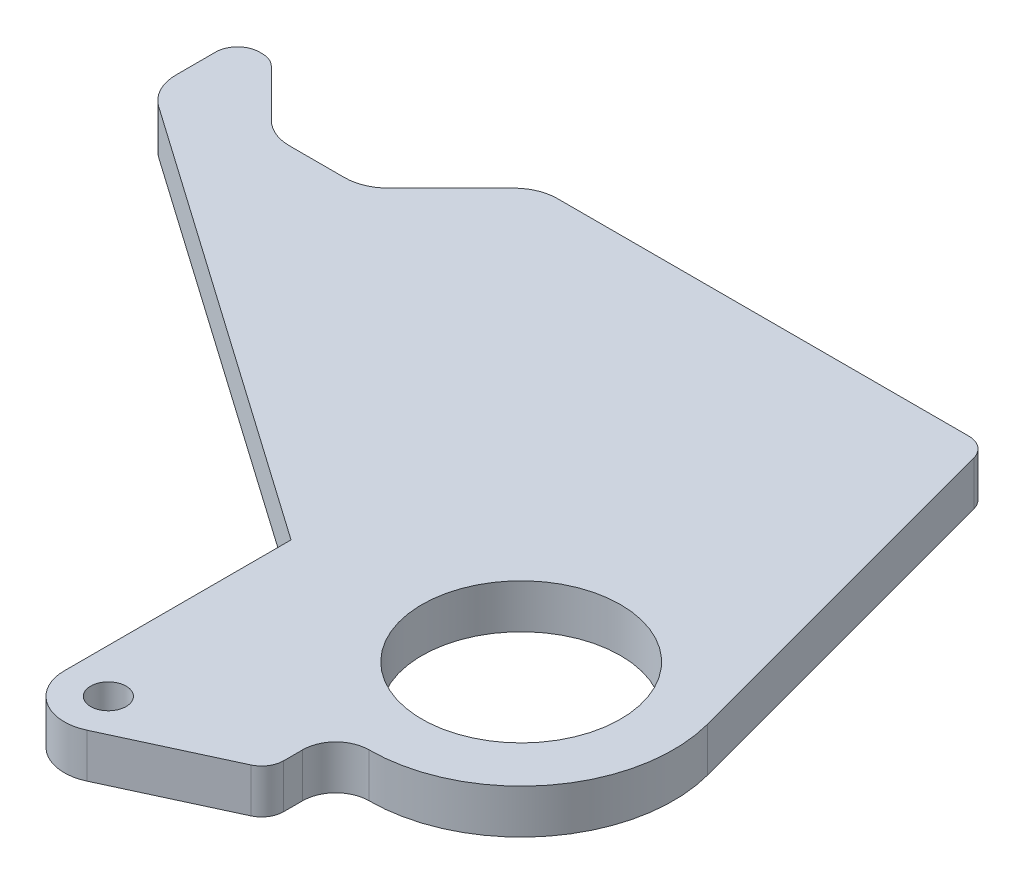
ISO-10303-21;
HEADER;
FILE_DESCRIPTION(('STEP AP214'),'2;1');
FILE_NAME('part.step','',(''),(''),'','','');
FILE_SCHEMA(('AUTOMOTIVE_DESIGN { 1 0 10303 214 1 1 1 1 }'));
ENDSEC;
DATA;
#1=APPLICATION_CONTEXT('core data for automotive mechanical design processes');
#2=APPLICATION_PROTOCOL_DEFINITION('international standard','automotive_design',2000,#1);
#3=PRODUCT_CONTEXT('',#1,'mechanical');
#4=PRODUCT('Part','Part','',(#3));
#5=PRODUCT_RELATED_PRODUCT_CATEGORY('part','',(#4));
#6=PRODUCT_DEFINITION_FORMATION('','',#4);
#7=PRODUCT_DEFINITION_CONTEXT('part definition',#1,'design');
#8=PRODUCT_DEFINITION('design','',#6,#7);
#9=PRODUCT_DEFINITION_SHAPE('','',#8);
#10=(LENGTH_UNIT() NAMED_UNIT(*) SI_UNIT(.MILLI.,.METRE.));
#11=(NAMED_UNIT(*) PLANE_ANGLE_UNIT() SI_UNIT($,.RADIAN.));
#12=(NAMED_UNIT(*) SI_UNIT($,.STERADIAN.) SOLID_ANGLE_UNIT());
#13=UNCERTAINTY_MEASURE_WITH_UNIT(LENGTH_MEASURE(1.E-05),#10,'distance_accuracy_value','');
#14=(GEOMETRIC_REPRESENTATION_CONTEXT(3) GLOBAL_UNCERTAINTY_ASSIGNED_CONTEXT((#13)) GLOBAL_UNIT_ASSIGNED_CONTEXT((#10,
#11,#12)) REPRESENTATION_CONTEXT('',''));
#15=CARTESIAN_POINT('',(0.,0.,0.));
#16=DIRECTION('',(0.,0.,1.));
#17=DIRECTION('',(1.,0.,0.));
#18=AXIS2_PLACEMENT_3D('',#15,#16,#17);
#19=CARTESIAN_POINT('',(4.08001470209326,-6.35,6.35));
#20=DIRECTION('',(0.,1.,0.));
#21=DIRECTION('',(0.,0.,1.));
#22=AXIS2_PLACEMENT_3D('',#19,#20,#21);
#23=CYLINDRICAL_SURFACE('',#22,3.175);
#24=CARTESIAN_POINT('',(4.08001470209326,0.,6.35));
#25=DIRECTION('',(0.,1.,0.));
#26=DIRECTION('',(0.,0.,1.));
#27=AXIS2_PLACEMENT_3D('',#24,#25,#26);
#28=CIRCLE('',#27,3.175);
#29=CARTESIAN_POINT('',(7.14682920056105,0.,5.5282495317995));
#30=VERTEX_POINT('',#29);
#31=CARTESIAN_POINT('',(4.08001470209326,0.,3.175));
#32=VERTEX_POINT('',#31);
#33=EDGE_CURVE('E224',#30,#32,#28,.T.);
#34=ORIENTED_EDGE('',*,*,#33,.F.);
#35=DIRECTION('',(0.,1.,0.));
#36=VECTOR('',#35,1.);
#37=CARTESIAN_POINT('',(7.14682920056105,-6.35,5.5282495317995));
#38=LINE('',#37,#36);
#39=CARTESIAN_POINT('',(7.14682920056105,-6.35,5.5282495317995));
#40=VERTEX_POINT('',#39);
#41=EDGE_CURVE('E11',#40,#30,#38,.T.);
#42=ORIENTED_EDGE('',*,*,#41,.F.);
#43=CARTESIAN_POINT('',(4.08001470209326,-6.35,6.35));
#44=DIRECTION('',(0.,1.,0.));
#45=DIRECTION('',(0.,0.,1.));
#46=AXIS2_PLACEMENT_3D('',#43,#44,#45);
#47=CIRCLE('',#46,3.175);
#48=CARTESIAN_POINT('',(4.08001470209326,-6.35,3.175));
#49=VERTEX_POINT('',#48);
#50=EDGE_CURVE('E287',#40,#49,#47,.T.);
#51=ORIENTED_EDGE('',*,*,#50,.T.);
#52=DIRECTION('',(0.,1.,0.));
#53=VECTOR('',#52,1.);
#54=CARTESIAN_POINT('',(4.08001470209326,-6.35,3.175));
#55=LINE('',#54,#53);
#56=EDGE_CURVE('E46',#49,#32,#55,.T.);
#57=ORIENTED_EDGE('',*,*,#56,.T.);
#58=EDGE_LOOP('',(#34,#42,#51,#57));
#59=FACE_BOUND('',#58,.T.);
#60=ADVANCED_FACE('F43',(#59),#23,.T.);
#61=CARTESIAN_POINT('',(21.1610200394277,-6.35,57.8299217694121));
#62=DIRECTION('',(0.965925826289063,0.,-0.258819045102539));
#63=DIRECTION('',(-0.258819045102539,0.,-0.965925826289064));
#64=AXIS2_PLACEMENT_3D('',#61,#62,#63);
#65=PLANE('',#64);
#66=DIRECTION('',(-0.258819045102539,0.,-0.965925826289063));
#67=VECTOR('',#66,1.);
#68=CARTESIAN_POINT('',(21.1610200394277,0.,57.8299217694121));
#69=LINE('',#68,#67);
#70=CARTESIAN_POINT('',(21.1610200394277,0.,57.8299217694121));
#71=VERTEX_POINT('',#70);
#72=EDGE_CURVE('E285',#71,#30,#69,.T.);
#73=ORIENTED_EDGE('',*,*,#72,.F.);
#74=DIRECTION('',(0.,1.,0.));
#75=VECTOR('',#74,1.);
#76=CARTESIAN_POINT('',(21.1610200394277,-6.35,57.8299217694121));
#77=LINE('',#76,#75);
#78=CARTESIAN_POINT('',(21.1610200394277,-6.35,57.8299217694121));
#79=VERTEX_POINT('',#78);
#80=EDGE_CURVE('E52',#79,#71,#77,.T.);
#81=ORIENTED_EDGE('',*,*,#80,.F.);
#82=DIRECTION('',(-0.258819045102539,0.,-0.965925826289063));
#83=VECTOR('',#82,1.);
#84=CARTESIAN_POINT('',(21.1610200394277,-6.35,57.8299217694121));
#85=LINE('',#84,#83);
#86=EDGE_CURVE('E214',#79,#40,#85,.T.);
#87=ORIENTED_EDGE('',*,*,#86,.T.);
#88=ORIENTED_EDGE('',*,*,#41,.T.);
#89=EDGE_LOOP('',(#73,#81,#87,#88));
#90=FACE_BOUND('',#89,.T.);
#91=ADVANCED_FACE('F327',(#90),#65,.T.);
#92=CARTESIAN_POINT('',(0.,-6.35,63.499999999996));
#93=DIRECTION('',(0.,1.,0.));
#94=DIRECTION('',(0.,0.,1.));
#95=AXIS2_PLACEMENT_3D('',#92,#93,#94);
#96=CYLINDRICAL_SURFACE('',#95,21.9075);
#97=CARTESIAN_POINT('',(0.,0.,63.499999999996));
#98=DIRECTION('',(0.,1.,0.));
#99=DIRECTION('',(0.,0.,1.));
#100=AXIS2_PLACEMENT_3D('',#97,#98,#99);
#101=CIRCLE('',#100,21.9075);
#102=CARTESIAN_POINT('',(0.,0.,85.4074999999961));
#103=VERTEX_POINT('',#102);
#104=EDGE_CURVE('E201',#103,#71,#101,.T.);
#105=ORIENTED_EDGE('',*,*,#104,.F.);
#106=DIRECTION('',(0.,1.,0.));
#107=VECTOR('',#106,1.);
#108=CARTESIAN_POINT('',(0.,-6.35,85.4074999999961));
#109=LINE('',#108,#107);
#110=CARTESIAN_POINT('',(0.,-6.35,85.4074999999961));
#111=VERTEX_POINT('',#110);
#112=EDGE_CURVE('E196',#111,#103,#109,.T.);
#113=ORIENTED_EDGE('',*,*,#112,.F.);
#114=CARTESIAN_POINT('',(0.,-6.35,63.499999999996));
#115=DIRECTION('',(0.,1.,0.));
#116=DIRECTION('',(0.,0.,1.));
#117=AXIS2_PLACEMENT_3D('',#114,#115,#116);
#118=CIRCLE('',#117,21.9075);
#119=EDGE_CURVE('E199',#111,#79,#118,.T.);
#120=ORIENTED_EDGE('',*,*,#119,.T.);
#121=ORIENTED_EDGE('',*,*,#80,.T.);
#122=EDGE_LOOP('',(#105,#113,#120,#121));
#123=FACE_BOUND('',#122,.T.);
#124=ADVANCED_FACE('F198',(#123),#96,.T.);
#125=CARTESIAN_POINT('',(0.,-6.35,90.1699999999961));
#126=DIRECTION('',(0.,1.,0.));
#127=DIRECTION('',(0.,0.,1.));
#128=AXIS2_PLACEMENT_3D('',#125,#126,#127);
#129=CYLINDRICAL_SURFACE('',#128,4.76250000000001);
#130=CARTESIAN_POINT('',(0.,0.,90.1699999999961));
#131=DIRECTION('',(0.,-1.,0.));
#132=DIRECTION('',(0.,0.,-1.));
#133=AXIS2_PLACEMENT_3D('',#130,#131,#132);
#134=CIRCLE('',#133,4.76250000000001);
#135=CARTESIAN_POINT('',(-4.7625,0.,90.1699999999961));
#136=VERTEX_POINT('',#135);
#137=EDGE_CURVE('E282',#136,#103,#134,.T.);
#138=ORIENTED_EDGE('',*,*,#137,.F.);
#139=DIRECTION('',(0.,1.,0.));
#140=VECTOR('',#139,1.);
#141=CARTESIAN_POINT('',(-4.7625,-6.35,90.1699999999961));
#142=LINE('',#141,#140);
#143=CARTESIAN_POINT('',(-4.7625,-6.35,90.1699999999961));
#144=VERTEX_POINT('',#143);
#145=EDGE_CURVE('E206',#144,#136,#142,.T.);
#146=ORIENTED_EDGE('',*,*,#145,.F.);
#147=CARTESIAN_POINT('',(0.,-6.35,90.1699999999961));
#148=DIRECTION('',(0.,-1.,0.));
#149=DIRECTION('',(0.,0.,-1.));
#150=AXIS2_PLACEMENT_3D('',#147,#148,#149);
#151=CIRCLE('',#150,4.76250000000001);
#152=EDGE_CURVE('E212',#144,#111,#151,.T.);
#153=ORIENTED_EDGE('',*,*,#152,.T.);
#154=ORIENTED_EDGE('',*,*,#112,.T.);
#155=EDGE_LOOP('',(#138,#146,#153,#154));
#156=FACE_BOUND('',#155,.T.);
#157=ADVANCED_FACE('F216',(#156),#129,.F.);
#158=CARTESIAN_POINT('',(-4.7625,-6.35,92.9032270908187));
#159=DIRECTION('',(1.,0.,0.));
#160=DIRECTION('',(0.,0.,-1.));
#161=AXIS2_PLACEMENT_3D('',#158,#159,#160);
#162=PLANE('',#161);
#163=DIRECTION('',(0.,0.,-1.));
#164=VECTOR('',#163,1.);
#165=CARTESIAN_POINT('',(-4.7625,0.,92.9032270908187));
#166=LINE('',#165,#164);
#167=CARTESIAN_POINT('',(-4.76249999999999,0.,92.9032270908187));
#168=VERTEX_POINT('',#167);
#169=EDGE_CURVE('E279',#168,#136,#166,.T.);
#170=ORIENTED_EDGE('',*,*,#169,.F.);
#171=DIRECTION('',(0.,1.,0.));
#172=VECTOR('',#171,1.);
#173=CARTESIAN_POINT('',(-4.76249999999999,-6.35,92.9032270908187));
#174=LINE('',#173,#172);
#175=CARTESIAN_POINT('',(-4.76249999999999,-6.35,92.9032270908187));
#176=VERTEX_POINT('',#175);
#177=EDGE_CURVE('E291',#176,#168,#174,.T.);
#178=ORIENTED_EDGE('',*,*,#177,.F.);
#179=DIRECTION('',(0.,0.,-1.));
#180=VECTOR('',#179,1.);
#181=CARTESIAN_POINT('',(-4.7625,-6.35,92.9032270908187));
#182=LINE('',#181,#180);
#183=EDGE_CURVE('E217',#176,#144,#182,.T.);
#184=ORIENTED_EDGE('',*,*,#183,.T.);
#185=ORIENTED_EDGE('',*,*,#145,.T.);
#186=EDGE_LOOP('',(#170,#178,#184,#185));
#187=FACE_BOUND('',#186,.T.);
#188=ADVANCED_FACE('F340',(#187),#162,.T.);
#189=CARTESIAN_POINT('',(-7.9375,-6.35,92.9032270908187));
#190=DIRECTION('',(0.,1.,0.));
#191=DIRECTION('',(0.,0.,1.));
#192=AXIS2_PLACEMENT_3D('',#189,#190,#191);
#193=CYLINDRICAL_SURFACE('',#192,3.17500000000001);
#194=CARTESIAN_POINT('',(-7.9375,0.,92.9032270908187));
#195=DIRECTION('',(0.,1.,0.));
#196=DIRECTION('',(0.,0.,1.));
#197=AXIS2_PLACEMENT_3D('',#194,#195,#196);
#198=CIRCLE('',#197,3.17500000000001);
#199=CARTESIAN_POINT('',(-6.60416199196349,0.,95.7846910861387));
#200=VERTEX_POINT('',#199);
#201=EDGE_CURVE('E276',#200,#168,#198,.T.);
#202=ORIENTED_EDGE('',*,*,#201,.F.);
#203=DIRECTION('',(0.,1.,0.));
#204=VECTOR('',#203,1.);
#205=CARTESIAN_POINT('',(-6.60416199196349,-6.35,95.7846910861387));
#206=LINE('',#205,#204);
#207=CARTESIAN_POINT('',(-6.60416199196349,-6.35,95.7846910861387));
#208=VERTEX_POINT('',#207);
#209=EDGE_CURVE('E293',#208,#200,#206,.T.);
#210=ORIENTED_EDGE('',*,*,#209,.F.);
#211=CARTESIAN_POINT('',(-7.9375,-6.35,92.9032270908187));
#212=DIRECTION('',(0.,1.,0.));
#213=DIRECTION('',(0.,0.,1.));
#214=AXIS2_PLACEMENT_3D('',#211,#212,#213);
#215=CIRCLE('',#214,3.17500000000001);
#216=EDGE_CURVE('E219',#208,#176,#215,.T.);
#217=ORIENTED_EDGE('',*,*,#216,.T.);
#218=ORIENTED_EDGE('',*,*,#177,.T.);
#219=EDGE_LOOP('',(#202,#210,#217,#218));
#220=FACE_BOUND('',#219,.T.);
#221=ADVANCED_FACE('F343',(#220),#193,.T.);
#222=CARTESIAN_POINT('',(-22.7333239839268,-6.35,103.24812799064));
#223=DIRECTION('',(0.419948978909138,0.,0.907547715061402));
#224=DIRECTION('',(0.907547715061402,0.,-0.419948978909138));
#225=AXIS2_PLACEMENT_3D('',#222,#223,#224);
#226=PLANE('',#225);
#227=DIRECTION('',(0.907547715061402,0.,-0.419948978909138));
#228=VECTOR('',#227,1.);
#229=CARTESIAN_POINT('',(-22.7333239839268,0.,103.24812799064));
#230=LINE('',#229,#228);
#231=CARTESIAN_POINT('',(-22.7333239839269,0.,103.24812799064));
#232=VERTEX_POINT('',#231);
#233=EDGE_CURVE('E273',#232,#200,#230,.T.);
#234=ORIENTED_EDGE('',*,*,#233,.F.);
#235=DIRECTION('',(0.,1.,0.));
#236=VECTOR('',#235,1.);
#237=CARTESIAN_POINT('',(-22.7333239839269,-6.35,103.24812799064));
#238=LINE('',#237,#236);
#239=CARTESIAN_POINT('',(-22.7333239839269,-6.35,103.24812799064));
#240=VERTEX_POINT('',#239);
#241=EDGE_CURVE('E295',#240,#232,#238,.T.);
#242=ORIENTED_EDGE('',*,*,#241,.F.);
#243=DIRECTION('',(0.907547715061402,0.,-0.419948978909138));
#244=VECTOR('',#243,1.);
#245=CARTESIAN_POINT('',(-22.7333239839268,-6.35,103.24812799064));
#246=LINE('',#245,#244);
#247=EDGE_CURVE('E487',#240,#208,#246,.T.);
#248=ORIENTED_EDGE('',*,*,#247,.T.);
#249=ORIENTED_EDGE('',*,*,#209,.T.);
#250=EDGE_LOOP('',(#234,#242,#248,#249));
#251=FACE_BOUND('',#250,.T.);
#252=ADVANCED_FACE('F347',(#251),#226,.T.);
#253=CARTESIAN_POINT('',(-25.4,-6.35,97.4852));
#254=DIRECTION('',(0.,1.,0.));
#255=DIRECTION('',(0.,0.,1.));
#256=AXIS2_PLACEMENT_3D('',#253,#254,#255);
#257=CYLINDRICAL_SURFACE('',#256,6.35000000000006);
#258=CARTESIAN_POINT('',(-25.4,0.,97.4852));
#259=DIRECTION('',(0.,1.,0.));
#260=DIRECTION('',(0.,0.,1.));
#261=AXIS2_PLACEMENT_3D('',#258,#259,#260);
#262=CIRCLE('',#261,6.35000000000006);
#263=CARTESIAN_POINT('',(-31.75,0.,97.4852));
#264=VERTEX_POINT('',#263);
#265=EDGE_CURVE('E270',#264,#232,#262,.T.);
#266=ORIENTED_EDGE('',*,*,#265,.F.);
#267=DIRECTION('',(0.,1.,0.));
#268=VECTOR('',#267,1.);
#269=CARTESIAN_POINT('',(-31.75,-6.35,97.4852));
#270=LINE('',#269,#268);
#271=CARTESIAN_POINT('',(-31.75,-6.35,97.4852));
#272=VERTEX_POINT('',#271);
#273=EDGE_CURVE('E297',#272,#264,#270,.T.);
#274=ORIENTED_EDGE('',*,*,#273,.F.);
#275=CARTESIAN_POINT('',(-25.4,-6.35,97.4852));
#276=DIRECTION('',(0.,1.,0.));
#277=DIRECTION('',(0.,0.,1.));
#278=AXIS2_PLACEMENT_3D('',#275,#276,#277);
#279=CIRCLE('',#278,6.35000000000006);
#280=EDGE_CURVE('E484',#272,#240,#279,.T.);
#281=ORIENTED_EDGE('',*,*,#280,.T.);
#282=ORIENTED_EDGE('',*,*,#241,.T.);
#283=EDGE_LOOP('',(#266,#274,#281,#282));
#284=FACE_BOUND('',#283,.T.);
#285=ADVANCED_FACE('F351',(#284),#257,.T.);
#286=CARTESIAN_POINT('',(-31.75,-6.35,64.8593277153634));
#287=DIRECTION('',(-1.,0.,0.));
#288=DIRECTION('',(0.,0.,1.));
#289=AXIS2_PLACEMENT_3D('',#286,#287,#288);
#290=PLANE('',#289);
#291=DIRECTION('',(0.,0.,1.));
#292=VECTOR('',#291,1.);
#293=CARTESIAN_POINT('',(-31.75,0.,64.8593277153634));
#294=LINE('',#293,#292);
#295=CARTESIAN_POINT('',(-31.75,0.,64.8593277153634));
#296=VERTEX_POINT('',#295);
#297=EDGE_CURVE('E267',#296,#264,#294,.T.);
#298=ORIENTED_EDGE('',*,*,#297,.F.);
#299=DIRECTION('',(0.,1.,0.));
#300=VECTOR('',#299,1.);
#301=CARTESIAN_POINT('',(-31.75,-6.35,64.8593277153634));
#302=LINE('',#301,#300);
#303=CARTESIAN_POINT('',(-31.75,-6.35,64.8593277153634));
#304=VERTEX_POINT('',#303);
#305=EDGE_CURVE('E299',#304,#296,#302,.T.);
#306=ORIENTED_EDGE('',*,*,#305,.F.);
#307=DIRECTION('',(0.,0.,1.));
#308=VECTOR('',#307,1.);
#309=CARTESIAN_POINT('',(-31.75,-6.35,64.8593277153634));
#310=LINE('',#309,#308);
#311=EDGE_CURVE('E481',#304,#272,#310,.T.);
#312=ORIENTED_EDGE('',*,*,#311,.T.);
#313=ORIENTED_EDGE('',*,*,#273,.T.);
#314=EDGE_LOOP('',(#298,#306,#312,#313));
#315=FACE_BOUND('',#314,.T.);
#316=ADVANCED_FACE('F355',(#315),#290,.T.);
#317=CARTESIAN_POINT('',(-95.2409603708292,-6.35,20.4024786555341));
#318=DIRECTION('',(-0.573576436351052,0.,0.819152044288987));
#319=DIRECTION('',(0.819152044288987,0.,0.573576436351052));
#320=AXIS2_PLACEMENT_3D('',#317,#318,#319);
#321=PLANE('',#320);
#322=DIRECTION('',(0.819152044288987,0.,0.573576436351052));
#323=VECTOR('',#322,1.);
#324=CARTESIAN_POINT('',(-95.2409603708292,0.,20.4024786555341));
#325=LINE('',#324,#323);
#326=CARTESIAN_POINT('',(-95.2409603708292,0.,20.4024786555341));
#327=VERTEX_POINT('',#326);
#328=EDGE_CURVE('E264',#327,#296,#325,.T.);
#329=ORIENTED_EDGE('',*,*,#328,.F.);
#330=DIRECTION('',(0.,1.,0.));
#331=VECTOR('',#330,1.);
#332=CARTESIAN_POINT('',(-95.2409603708292,-6.35,20.4024786555341));
#333=LINE('',#332,#331);
#334=CARTESIAN_POINT('',(-95.2409603708292,-6.35,20.4024786555341));
#335=VERTEX_POINT('',#334);
#336=EDGE_CURVE('E301',#335,#327,#333,.T.);
#337=ORIENTED_EDGE('',*,*,#336,.F.);
#338=DIRECTION('',(0.819152044288987,0.,0.573576436351052));
#339=VECTOR('',#338,1.);
#340=CARTESIAN_POINT('',(-95.2409603708292,-6.35,20.4024786555341));
#341=LINE('',#340,#339);
#342=EDGE_CURVE('E478',#335,#304,#341,.T.);
#343=ORIENTED_EDGE('',*,*,#342,.T.);
#344=ORIENTED_EDGE('',*,*,#305,.T.);
#345=EDGE_LOOP('',(#329,#337,#343,#344));
#346=FACE_BOUND('',#345,.T.);
#347=ADVANCED_FACE('F359',(#346),#321,.T.);
#348=CARTESIAN_POINT('',(-91.59875,-6.35,15.2008631742991));
#349=DIRECTION('',(0.,1.,0.));
#350=DIRECTION('',(0.,0.,1.));
#351=AXIS2_PLACEMENT_3D('',#348,#349,#350);
#352=CYLINDRICAL_SURFACE('',#351,6.34999999999997);
#353=CARTESIAN_POINT('',(-91.59875,0.,15.2008631742991));
#354=DIRECTION('',(0.,1.,0.));
#355=DIRECTION('',(0.,0.,1.));
#356=AXIS2_PLACEMENT_3D('',#353,#354,#355);
#357=CIRCLE('',#356,6.34999999999997);
#358=CARTESIAN_POINT('',(-97.94875,0.,15.2008631742991));
#359=VERTEX_POINT('',#358);
#360=EDGE_CURVE('E261',#359,#327,#357,.T.);
#361=ORIENTED_EDGE('',*,*,#360,.F.);
#362=DIRECTION('',(0.,1.,0.));
#363=VECTOR('',#362,1.);
#364=CARTESIAN_POINT('',(-97.94875,-6.35,15.2008631742991));
#365=LINE('',#364,#363);
#366=CARTESIAN_POINT('',(-97.94875,-6.35,15.2008631742991));
#367=VERTEX_POINT('',#366);
#368=EDGE_CURVE('E303',#367,#359,#365,.T.);
#369=ORIENTED_EDGE('',*,*,#368,.F.);
#370=CARTESIAN_POINT('',(-91.59875,-6.35,15.2008631742991));
#371=DIRECTION('',(0.,1.,0.));
#372=DIRECTION('',(0.,0.,1.));
#373=AXIS2_PLACEMENT_3D('',#370,#371,#372);
#374=CIRCLE('',#373,6.34999999999997);
#375=EDGE_CURVE('E475',#367,#335,#374,.T.);
#376=ORIENTED_EDGE('',*,*,#375,.T.);
#377=ORIENTED_EDGE('',*,*,#336,.T.);
#378=EDGE_LOOP('',(#361,#369,#376,#377));
#379=FACE_BOUND('',#378,.T.);
#380=ADVANCED_FACE('F363',(#379),#352,.T.);
#381=CARTESIAN_POINT('',(-97.94875,-6.35,9.525));
#382=DIRECTION('',(-1.,0.,0.));
#383=DIRECTION('',(0.,0.,1.));
#384=AXIS2_PLACEMENT_3D('',#381,#382,#383);
#385=PLANE('',#384);
#386=DIRECTION('',(0.,0.,1.));
#387=VECTOR('',#386,1.);
#388=CARTESIAN_POINT('',(-97.94875,0.,9.525));
#389=LINE('',#388,#387);
#390=CARTESIAN_POINT('',(-97.94875,0.,9.525));
#391=VERTEX_POINT('',#390);
#392=EDGE_CURVE('E258',#391,#359,#389,.T.);
#393=ORIENTED_EDGE('',*,*,#392,.F.);
#394=DIRECTION('',(0.,1.,0.));
#395=VECTOR('',#394,1.);
#396=CARTESIAN_POINT('',(-97.94875,-6.35,9.525));
#397=LINE('',#396,#395);
#398=CARTESIAN_POINT('',(-97.94875,-6.35,9.525));
#399=VERTEX_POINT('',#398);
#400=EDGE_CURVE('E305',#399,#391,#397,.T.);
#401=ORIENTED_EDGE('',*,*,#400,.F.);
#402=DIRECTION('',(0.,0.,1.));
#403=VECTOR('',#402,1.);
#404=CARTESIAN_POINT('',(-97.94875,-6.35,9.525));
#405=LINE('',#404,#403);
#406=EDGE_CURVE('E472',#399,#367,#405,.T.);
#407=ORIENTED_EDGE('',*,*,#406,.T.);
#408=ORIENTED_EDGE('',*,*,#368,.T.);
#409=EDGE_LOOP('',(#393,#401,#407,#408));
#410=FACE_BOUND('',#409,.T.);
#411=ADVANCED_FACE('F367',(#410),#385,.T.);
#412=CARTESIAN_POINT('',(-94.77375,-6.35,9.525));
#413=DIRECTION('',(0.,1.,0.));
#414=DIRECTION('',(0.,0.,1.));
#415=AXIS2_PLACEMENT_3D('',#412,#413,#414);
#416=CYLINDRICAL_SURFACE('',#415,3.175);
#417=CARTESIAN_POINT('',(-94.77375,0.,9.525));
#418=DIRECTION('',(0.,1.,0.));
#419=DIRECTION('',(0.,0.,1.));
#420=AXIS2_PLACEMENT_3D('',#417,#418,#419);
#421=CIRCLE('',#420,3.175);
#422=CARTESIAN_POINT('',(-94.77375,0.,6.35));
#423=VERTEX_POINT('',#422);
#424=EDGE_CURVE('E255',#423,#391,#421,.T.);
#425=ORIENTED_EDGE('',*,*,#424,.F.);
#426=DIRECTION('',(0.,1.,0.));
#427=VECTOR('',#426,1.);
#428=CARTESIAN_POINT('',(-94.77375,-6.35,6.35));
#429=LINE('',#428,#427);
#430=CARTESIAN_POINT('',(-94.77375,-6.35,6.35));
#431=VERTEX_POINT('',#430);
#432=EDGE_CURVE('E307',#431,#423,#429,.T.);
#433=ORIENTED_EDGE('',*,*,#432,.F.);
#434=CARTESIAN_POINT('',(-94.77375,-6.35,9.525));
#435=DIRECTION('',(0.,1.,0.));
#436=DIRECTION('',(0.,0.,1.));
#437=AXIS2_PLACEMENT_3D('',#434,#435,#436);
#438=CIRCLE('',#437,3.175);
#439=EDGE_CURVE('E469',#431,#399,#438,.T.);
#440=ORIENTED_EDGE('',*,*,#439,.T.);
#441=ORIENTED_EDGE('',*,*,#400,.T.);
#442=EDGE_LOOP('',(#425,#433,#440,#441));
#443=FACE_BOUND('',#442,.T.);
#444=ADVANCED_FACE('F371',(#443),#416,.T.);
#445=CARTESIAN_POINT('',(-94.4095183632075,-6.35,6.35));
#446=DIRECTION('',(0.,0.,-1.));
#447=DIRECTION('',(-1.,0.,0.));
#448=AXIS2_PLACEMENT_3D('',#445,#446,#447);
#449=PLANE('',#448);
#450=DIRECTION('',(-1.,0.,0.));
#451=VECTOR('',#450,1.);
#452=CARTESIAN_POINT('',(-94.4095183632075,0.,6.35));
#453=LINE('',#452,#451);
#454=CARTESIAN_POINT('',(-94.4095183632075,0.,6.35));
#455=VERTEX_POINT('',#454);
#456=EDGE_CURVE('E252',#455,#423,#453,.T.);
#457=ORIENTED_EDGE('',*,*,#456,.F.);
#458=DIRECTION('',(0.,1.,0.));
#459=VECTOR('',#458,1.);
#460=CARTESIAN_POINT('',(-94.4095183632075,-6.35,6.35));
#461=LINE('',#460,#459);
#462=CARTESIAN_POINT('',(-94.4095183632075,-6.35,6.35));
#463=VERTEX_POINT('',#462);
#464=EDGE_CURVE('E309',#463,#455,#461,.T.);
#465=ORIENTED_EDGE('',*,*,#464,.F.);
#466=DIRECTION('',(-1.,0.,0.));
#467=VECTOR('',#466,1.);
#468=CARTESIAN_POINT('',(-94.4095183632075,-6.35,6.35));
#469=LINE('',#468,#467);
#470=EDGE_CURVE('E466',#463,#431,#469,.T.);
#471=ORIENTED_EDGE('',*,*,#470,.T.);
#472=ORIENTED_EDGE('',*,*,#432,.T.);
#473=EDGE_LOOP('',(#457,#465,#471,#472));
#474=FACE_BOUND('',#473,.T.);
#475=ADVANCED_FACE('F375',(#474),#449,.T.);
#476=CARTESIAN_POINT('',(-94.4095183632075,-6.35,9.525));
#477=DIRECTION('',(0.,1.,0.));
#478=DIRECTION('',(0.,0.,1.));
#479=AXIS2_PLACEMENT_3D('',#476,#477,#478);
#480=CYLINDRICAL_SURFACE('',#479,3.175);
#481=CARTESIAN_POINT('',(-94.4095183632075,0.,9.525));
#482=DIRECTION('',(0.,1.,0.));
#483=DIRECTION('',(0.,0.,1.));
#484=AXIS2_PLACEMENT_3D('',#481,#482,#483);
#485=CIRCLE('',#484,3.175);
#486=CARTESIAN_POINT('',(-92.1644543329402,0.,7.2799359697327));
#487=VERTEX_POINT('',#486);
#488=EDGE_CURVE('E249',#487,#455,#485,.T.);
#489=ORIENTED_EDGE('',*,*,#488,.F.);
#490=DIRECTION('',(0.,1.,0.));
#491=VECTOR('',#490,1.);
#492=CARTESIAN_POINT('',(-92.1644543329402,-6.35,7.2799359697327));
#493=LINE('',#492,#491);
#494=CARTESIAN_POINT('',(-92.1644543329402,-6.35,7.2799359697327));
#495=VERTEX_POINT('',#494);
#496=EDGE_CURVE('E311',#495,#487,#493,.T.);
#497=ORIENTED_EDGE('',*,*,#496,.F.);
#498=CARTESIAN_POINT('',(-94.4095183632075,-6.35,9.525));
#499=DIRECTION('',(0.,1.,0.));
#500=DIRECTION('',(0.,0.,1.));
#501=AXIS2_PLACEMENT_3D('',#498,#499,#500);
#502=CIRCLE('',#501,3.175);
#503=EDGE_CURVE('E463',#495,#463,#502,.T.);
#504=ORIENTED_EDGE('',*,*,#503,.T.);
#505=ORIENTED_EDGE('',*,*,#464,.T.);
#506=EDGE_LOOP('',(#489,#497,#504,#505));
#507=FACE_BOUND('',#506,.T.);
#508=ADVANCED_FACE('F379',(#507),#480,.T.);
#509=CARTESIAN_POINT('',(-85.4292622421383,-6.35,14.0151280605346));
#510=DIRECTION('',(0.707106781186545,0.,-0.70710678118655));
#511=DIRECTION('',(-0.70710678118655,0.,-0.707106781186545));
#512=AXIS2_PLACEMENT_3D('',#509,#510,#511);
#513=PLANE('',#512);
#514=DIRECTION('',(-0.707106781186551,0.,-0.707106781186545));
#515=VECTOR('',#514,1.);
#516=CARTESIAN_POINT('',(-85.4292622421383,0.,14.0151280605346));
#517=LINE('',#516,#515);
#518=CARTESIAN_POINT('',(-85.4292622421383,0.,14.0151280605346));
#519=VERTEX_POINT('',#518);
#520=EDGE_CURVE('E246',#519,#487,#517,.T.);
#521=ORIENTED_EDGE('',*,*,#520,.F.);
#522=DIRECTION('',(0.,1.,0.));
#523=VECTOR('',#522,1.);
#524=CARTESIAN_POINT('',(-85.4292622421383,-6.35,14.0151280605346));
#525=LINE('',#524,#523);
#526=CARTESIAN_POINT('',(-85.4292622421383,-6.35,14.0151280605346));
#527=VERTEX_POINT('',#526);
#528=EDGE_CURVE('E313',#527,#519,#525,.T.);
#529=ORIENTED_EDGE('',*,*,#528,.F.);
#530=DIRECTION('',(-0.707106781186551,0.,-0.707106781186545));
#531=VECTOR('',#530,1.);
#532=CARTESIAN_POINT('',(-85.4292622421383,-6.35,14.0151280605346));
#533=LINE('',#532,#531);
#534=EDGE_CURVE('E460',#527,#495,#533,.T.);
#535=ORIENTED_EDGE('',*,*,#534,.T.);
#536=ORIENTED_EDGE('',*,*,#496,.T.);
#537=EDGE_LOOP('',(#521,#529,#535,#536));
#538=FACE_BOUND('',#537,.T.);
#539=ADVANCED_FACE('F383',(#538),#513,.T.);
#540=CARTESIAN_POINT('',(-80.9391341816037,-6.35,9.525));
#541=DIRECTION('',(0.,1.,0.));
#542=DIRECTION('',(0.,0.,1.));
#543=AXIS2_PLACEMENT_3D('',#540,#541,#542);
#544=CYLINDRICAL_SURFACE('',#543,6.35);
#545=CARTESIAN_POINT('',(-80.9391341816037,0.,9.525));
#546=DIRECTION('',(0.,-1.,0.));
#547=DIRECTION('',(0.,0.,-1.));
#548=AXIS2_PLACEMENT_3D('',#545,#546,#547);
#549=CIRCLE('',#548,6.35);
#550=CARTESIAN_POINT('',(-80.9391341816037,0.,15.875));
#551=VERTEX_POINT('',#550);
#552=EDGE_CURVE('E243',#551,#519,#549,.T.);
#553=ORIENTED_EDGE('',*,*,#552,.F.);
#554=DIRECTION('',(0.,1.,0.));
#555=VECTOR('',#554,1.);
#556=CARTESIAN_POINT('',(-80.9391341816037,-6.35,15.875));
#557=LINE('',#556,#555);
#558=CARTESIAN_POINT('',(-80.9391341816037,-6.35,15.875));
#559=VERTEX_POINT('',#558);
#560=EDGE_CURVE('E315',#559,#551,#557,.T.);
#561=ORIENTED_EDGE('',*,*,#560,.F.);
#562=CARTESIAN_POINT('',(-80.9391341816037,-6.35,9.525));
#563=DIRECTION('',(0.,-1.,0.));
#564=DIRECTION('',(0.,0.,-1.));
#565=AXIS2_PLACEMENT_3D('',#562,#563,#564);
#566=CIRCLE('',#565,6.35);
#567=EDGE_CURVE('E457',#559,#527,#566,.T.);
#568=ORIENTED_EDGE('',*,*,#567,.T.);
#569=ORIENTED_EDGE('',*,*,#528,.T.);
#570=EDGE_LOOP('',(#553,#561,#568,#569));
#571=FACE_BOUND('',#570,.T.);
#572=ADVANCED_FACE('F387',(#571),#544,.F.);
#573=CARTESIAN_POINT('',(-73.0483658183963,-6.35,15.875));
#574=DIRECTION('',(0.,0.,-1.));
#575=DIRECTION('',(-1.,0.,0.));
#576=AXIS2_PLACEMENT_3D('',#573,#574,#575);
#577=PLANE('',#576);
#578=DIRECTION('',(-1.,0.,0.));
#579=VECTOR('',#578,1.);
#580=CARTESIAN_POINT('',(-73.0483658183963,0.,15.875));
#581=LINE('',#580,#579);
#582=CARTESIAN_POINT('',(-73.0483658183963,0.,15.875));
#583=VERTEX_POINT('',#582);
#584=EDGE_CURVE('E240',#583,#551,#581,.T.);
#585=ORIENTED_EDGE('',*,*,#584,.F.);
#586=DIRECTION('',(0.,1.,0.));
#587=VECTOR('',#586,1.);
#588=CARTESIAN_POINT('',(-73.0483658183963,-6.35,15.875));
#589=LINE('',#588,#587);
#590=CARTESIAN_POINT('',(-73.0483658183963,-6.35,15.875));
#591=VERTEX_POINT('',#590);
#592=EDGE_CURVE('E317',#591,#583,#589,.T.);
#593=ORIENTED_EDGE('',*,*,#592,.F.);
#594=DIRECTION('',(-1.,0.,0.));
#595=VECTOR('',#594,1.);
#596=CARTESIAN_POINT('',(-73.0483658183963,-6.35,15.875));
#597=LINE('',#596,#595);
#598=EDGE_CURVE('E454',#591,#559,#597,.T.);
#599=ORIENTED_EDGE('',*,*,#598,.T.);
#600=ORIENTED_EDGE('',*,*,#560,.T.);
#601=EDGE_LOOP('',(#585,#593,#599,#600));
#602=FACE_BOUND('',#601,.T.);
#603=ADVANCED_FACE('F391',(#602),#577,.T.);
#604=CARTESIAN_POINT('',(-73.0483658183963,-6.35,9.525));
#605=DIRECTION('',(0.,1.,0.));
#606=DIRECTION('',(0.,0.,1.));
#607=AXIS2_PLACEMENT_3D('',#604,#605,#606);
#608=CYLINDRICAL_SURFACE('',#607,6.35000000000002);
#609=CARTESIAN_POINT('',(-73.0483658183963,0.,9.525));
#610=DIRECTION('',(0.,-1.,0.));
#611=DIRECTION('',(0.,0.,-1.));
#612=AXIS2_PLACEMENT_3D('',#609,#610,#611);
#613=CIRCLE('',#612,6.35000000000002);
#614=CARTESIAN_POINT('',(-68.5582377578617,0.,14.0151280605346));
#615=VERTEX_POINT('',#614);
#616=EDGE_CURVE('E237',#615,#583,#613,.T.);
#617=ORIENTED_EDGE('',*,*,#616,.F.);
#618=DIRECTION('',(0.,1.,0.));
#619=VECTOR('',#618,1.);
#620=CARTESIAN_POINT('',(-68.5582377578617,-6.35,14.0151280605346));
#621=LINE('',#620,#619);
#622=CARTESIAN_POINT('',(-68.5582377578617,-6.35,14.0151280605346));
#623=VERTEX_POINT('',#622);
#624=EDGE_CURVE('E319',#623,#615,#621,.T.);
#625=ORIENTED_EDGE('',*,*,#624,.F.);
#626=CARTESIAN_POINT('',(-73.0483658183963,-6.35,9.525));
#627=DIRECTION('',(0.,-1.,0.));
#628=DIRECTION('',(0.,0.,-1.));
#629=AXIS2_PLACEMENT_3D('',#626,#627,#628);
#630=CIRCLE('',#629,6.35000000000002);
#631=EDGE_CURVE('E451',#623,#591,#630,.T.);
#632=ORIENTED_EDGE('',*,*,#631,.T.);
#633=ORIENTED_EDGE('',*,*,#592,.T.);
#634=EDGE_LOOP('',(#617,#625,#632,#633));
#635=FACE_BOUND('',#634,.T.);
#636=ADVANCED_FACE('F395',(#635),#608,.F.);
#637=CARTESIAN_POINT('',(-59.5779816367925,-6.35,5.0348719394654));
#638=DIRECTION('',(-0.707106781186546,0.,-0.707106781186549));
#639=DIRECTION('',(-0.707106781186549,0.,0.707106781186546));
#640=AXIS2_PLACEMENT_3D('',#637,#638,#639);
#641=PLANE('',#640);
#642=DIRECTION('',(-0.707106781186549,0.,0.707106781186546));
#643=VECTOR('',#642,1.);
#644=CARTESIAN_POINT('',(-59.5779816367925,0.,5.0348719394654));
#645=LINE('',#644,#643);
#646=CARTESIAN_POINT('',(-59.5779816367925,0.,5.0348719394654));
#647=VERTEX_POINT('',#646);
#648=EDGE_CURVE('E234',#647,#615,#645,.T.);
#649=ORIENTED_EDGE('',*,*,#648,.F.);
#650=DIRECTION('',(0.,1.,0.));
#651=VECTOR('',#650,1.);
#652=CARTESIAN_POINT('',(-59.5779816367925,-6.35,5.0348719394654));
#653=LINE('',#652,#651);
#654=CARTESIAN_POINT('',(-59.5779816367925,-6.35,5.0348719394654));
#655=VERTEX_POINT('',#654);
#656=EDGE_CURVE('E321',#655,#647,#653,.T.);
#657=ORIENTED_EDGE('',*,*,#656,.F.);
#658=DIRECTION('',(-0.707106781186549,0.,0.707106781186546));
#659=VECTOR('',#658,1.);
#660=CARTESIAN_POINT('',(-59.5779816367925,-6.35,5.0348719394654));
#661=LINE('',#660,#659);
#662=EDGE_CURVE('E448',#655,#623,#661,.T.);
#663=ORIENTED_EDGE('',*,*,#662,.T.);
#664=ORIENTED_EDGE('',*,*,#624,.T.);
#665=EDGE_LOOP('',(#649,#657,#663,#664));
#666=FACE_BOUND('',#665,.T.);
#667=ADVANCED_FACE('F399',(#666),#641,.T.);
#668=CARTESIAN_POINT('',(-55.0878535762579,-6.35,9.525));
#669=DIRECTION('',(0.,1.,0.));
#670=DIRECTION('',(0.,0.,1.));
#671=AXIS2_PLACEMENT_3D('',#668,#669,#670);
#672=CYLINDRICAL_SURFACE('',#671,6.35);
#673=CARTESIAN_POINT('',(-55.0878535762579,0.,9.525));
#674=DIRECTION('',(0.,1.,0.));
#675=DIRECTION('',(0.,0.,1.));
#676=AXIS2_PLACEMENT_3D('',#673,#674,#675);
#677=CIRCLE('',#676,6.35);
#678=CARTESIAN_POINT('',(-55.0878535762579,0.,3.17499999999999));
#679=VERTEX_POINT('',#678);
#680=EDGE_CURVE('E231',#679,#647,#677,.T.);
#681=ORIENTED_EDGE('',*,*,#680,.F.);
#682=DIRECTION('',(0.,1.,0.));
#683=VECTOR('',#682,1.);
#684=CARTESIAN_POINT('',(-55.0878535762579,-6.35,3.17499999999999));
#685=LINE('',#684,#683);
#686=CARTESIAN_POINT('',(-55.0878535762579,-6.35,3.17499999999999));
#687=VERTEX_POINT('',#686);
#688=EDGE_CURVE('E322',#687,#679,#685,.T.);
#689=ORIENTED_EDGE('',*,*,#688,.F.);
#690=CARTESIAN_POINT('',(-55.0878535762579,-6.35,9.525));
#691=DIRECTION('',(0.,1.,0.));
#692=DIRECTION('',(0.,0.,1.));
#693=AXIS2_PLACEMENT_3D('',#690,#691,#692);
#694=CIRCLE('',#693,6.35);
#695=EDGE_CURVE('E445',#687,#655,#694,.T.);
#696=ORIENTED_EDGE('',*,*,#695,.T.);
#697=ORIENTED_EDGE('',*,*,#656,.T.);
#698=EDGE_LOOP('',(#681,#689,#696,#697));
#699=FACE_BOUND('',#698,.T.);
#700=ADVANCED_FACE('F403',(#699),#672,.T.);
#701=CARTESIAN_POINT('',(4.08001470209326,-6.35,3.175));
#702=DIRECTION('',(0.,0.,-1.));
#703=DIRECTION('',(-1.,0.,0.));
#704=AXIS2_PLACEMENT_3D('',#701,#702,#703);
#705=PLANE('',#704);
#706=DIRECTION('',(-1.,0.,0.));
#707=VECTOR('',#706,1.);
#708=CARTESIAN_POINT('',(4.08001470209326,0.,3.175));
#709=LINE('',#708,#707);
#710=EDGE_CURVE('E227',#32,#679,#709,.T.);
#711=ORIENTED_EDGE('',*,*,#710,.F.);
#712=ORIENTED_EDGE('',*,*,#56,.F.);
#713=DIRECTION('',(-1.,0.,0.));
#714=VECTOR('',#713,1.);
#715=CARTESIAN_POINT('',(4.08001470209326,-6.35,3.175));
#716=LINE('',#715,#714);
#717=EDGE_CURVE('E443',#49,#687,#716,.T.);
#718=ORIENTED_EDGE('',*,*,#717,.T.);
#719=ORIENTED_EDGE('',*,*,#688,.T.);
#720=EDGE_LOOP('',(#711,#712,#718,#719));
#721=FACE_BOUND('',#720,.T.);
#722=ADVANCED_FACE('F324',(#721),#705,.T.);
#723=CARTESIAN_POINT('',(4.08001470209326,-6.35,6.35));
#724=DIRECTION('',(0.,1.,0.));
#725=DIRECTION('',(0.,0.,1.));
#726=AXIS2_PLACEMENT_3D('',#723,#724,#725);
#727=PLANE('',#726);
#728=CARTESIAN_POINT('',(0.,-6.35,63.499999999996));
#729=DIRECTION('',(0.,1.,0.));
#730=DIRECTION('',(0.,0.,-1.));
#731=AXIS2_PLACEMENT_3D('',#728,#729,#730);
#732=CIRCLE('',#731,14.287499999996);
#733=CARTESIAN_POINT('',(0.,-6.35,49.2125));
#734=VERTEX_POINT('',#733);
#735=EDGE_CURVE('E430',#734,#734,#732,.T.);
#736=ORIENTED_EDGE('',*,*,#735,.T.);
#737=EDGE_LOOP('',(#736));
#738=FACE_BOUND('',#737,.T.);
#739=CARTESIAN_POINT('',(-25.4,-6.35,97.4852));
#740=DIRECTION('',(0.,1.,0.));
#741=DIRECTION('',(0.,0.,-1.));
#742=AXIS2_PLACEMENT_3D('',#739,#740,#741);
#743=CIRCLE('',#742,2.55270000000001);
#744=CARTESIAN_POINT('',(-25.4,-6.35,94.9325));
#745=VERTEX_POINT('',#744);
#746=EDGE_CURVE('E228',#745,#745,#743,.T.);
#747=ORIENTED_EDGE('',*,*,#746,.T.);
#748=EDGE_LOOP('',(#747));
#749=FACE_BOUND('',#748,.T.);
#750=ORIENTED_EDGE('',*,*,#50,.F.);
#751=ORIENTED_EDGE('',*,*,#86,.F.);
#752=ORIENTED_EDGE('',*,*,#119,.F.);
#753=ORIENTED_EDGE('',*,*,#152,.F.);
#754=ORIENTED_EDGE('',*,*,#183,.F.);
#755=ORIENTED_EDGE('',*,*,#216,.F.);
#756=ORIENTED_EDGE('',*,*,#247,.F.);
#757=ORIENTED_EDGE('',*,*,#280,.F.);
#758=ORIENTED_EDGE('',*,*,#311,.F.);
#759=ORIENTED_EDGE('',*,*,#342,.F.);
#760=ORIENTED_EDGE('',*,*,#375,.F.);
#761=ORIENTED_EDGE('',*,*,#406,.F.);
#762=ORIENTED_EDGE('',*,*,#439,.F.);
#763=ORIENTED_EDGE('',*,*,#470,.F.);
#764=ORIENTED_EDGE('',*,*,#503,.F.);
#765=ORIENTED_EDGE('',*,*,#534,.F.);
#766=ORIENTED_EDGE('',*,*,#567,.F.);
#767=ORIENTED_EDGE('',*,*,#598,.F.);
#768=ORIENTED_EDGE('',*,*,#631,.F.);
#769=ORIENTED_EDGE('',*,*,#662,.F.);
#770=ORIENTED_EDGE('',*,*,#695,.F.);
#771=ORIENTED_EDGE('',*,*,#717,.F.);
#772=EDGE_LOOP('',(#750,#751,#752,#753,#754,#755,#756,#757,#758,#759,#760,#761,#762,#763,#764,
#765,#766,#767,#768,#769,#770,#771));
#773=FACE_BOUND('',#772,.T.);
#774=ADVANCED_FACE('F210',(#738,#749,#773),#727,.F.);
#775=CARTESIAN_POINT('',(4.08001470209326,0.,6.35));
#776=DIRECTION('',(0.,1.,0.));
#777=DIRECTION('',(0.,0.,1.));
#778=AXIS2_PLACEMENT_3D('',#775,#776,#777);
#779=PLANE('',#778);
#780=CARTESIAN_POINT('',(0.,0.,63.499999999996));
#781=DIRECTION('',(0.,1.,0.));
#782=DIRECTION('',(0.,0.,-1.));
#783=AXIS2_PLACEMENT_3D('',#780,#781,#782);
#784=CIRCLE('',#783,14.287499999996);
#785=CARTESIAN_POINT('',(0.,0.,49.2125));
#786=VERTEX_POINT('',#785);
#787=EDGE_CURVE('E433',#786,#786,#784,.T.);
#788=ORIENTED_EDGE('',*,*,#787,.F.);
#789=EDGE_LOOP('',(#788));
#790=FACE_BOUND('',#789,.T.);
#791=CARTESIAN_POINT('',(-25.4,0.,97.4852));
#792=DIRECTION('',(0.,1.,0.));
#793=DIRECTION('',(0.,0.,-1.));
#794=AXIS2_PLACEMENT_3D('',#791,#792,#793);
#795=CIRCLE('',#794,2.55270000000001);
#796=CARTESIAN_POINT('',(-25.4,0.,94.9325));
#797=VERTEX_POINT('',#796);
#798=EDGE_CURVE('E435',#797,#797,#795,.T.);
#799=ORIENTED_EDGE('',*,*,#798,.F.);
#800=EDGE_LOOP('',(#799));
#801=FACE_BOUND('',#800,.T.);
#802=ORIENTED_EDGE('',*,*,#33,.T.);
#803=ORIENTED_EDGE('',*,*,#710,.T.);
#804=ORIENTED_EDGE('',*,*,#680,.T.);
#805=ORIENTED_EDGE('',*,*,#648,.T.);
#806=ORIENTED_EDGE('',*,*,#616,.T.);
#807=ORIENTED_EDGE('',*,*,#584,.T.);
#808=ORIENTED_EDGE('',*,*,#552,.T.);
#809=ORIENTED_EDGE('',*,*,#520,.T.);
#810=ORIENTED_EDGE('',*,*,#488,.T.);
#811=ORIENTED_EDGE('',*,*,#456,.T.);
#812=ORIENTED_EDGE('',*,*,#424,.T.);
#813=ORIENTED_EDGE('',*,*,#392,.T.);
#814=ORIENTED_EDGE('',*,*,#360,.T.);
#815=ORIENTED_EDGE('',*,*,#328,.T.);
#816=ORIENTED_EDGE('',*,*,#297,.T.);
#817=ORIENTED_EDGE('',*,*,#265,.T.);
#818=ORIENTED_EDGE('',*,*,#233,.T.);
#819=ORIENTED_EDGE('',*,*,#201,.T.);
#820=ORIENTED_EDGE('',*,*,#169,.T.);
#821=ORIENTED_EDGE('',*,*,#137,.T.);
#822=ORIENTED_EDGE('',*,*,#104,.T.);
#823=ORIENTED_EDGE('',*,*,#72,.T.);
#824=EDGE_LOOP('',(#802,#803,#804,#805,#806,#807,#808,#809,#810,#811,#812,#813,#814,#815,#816,
#817,#818,#819,#820,#821,#822,#823));
#825=FACE_BOUND('',#824,.T.);
#826=ADVANCED_FACE('F326',(#790,#801,#825),#779,.T.);
#827=CARTESIAN_POINT('',(-25.4,-6.35,97.4852));
#828=DIRECTION('',(0.,1.,0.));
#829=DIRECTION('',(0.,0.,1.));
#830=AXIS2_PLACEMENT_3D('',#827,#828,#829);
#831=CYLINDRICAL_SURFACE('',#830,2.55270000000001);
#832=ORIENTED_EDGE('',*,*,#746,.F.);
#833=EDGE_LOOP('',(#832));
#834=FACE_BOUND('',#833,.T.);
#835=ORIENTED_EDGE('',*,*,#798,.T.);
#836=EDGE_LOOP('',(#835));
#837=FACE_BOUND('',#836,.T.);
#838=ADVANCED_FACE('F415',(#834,#837),#831,.F.);
#839=CARTESIAN_POINT('',(0.,-6.35,63.499999999996));
#840=DIRECTION('',(0.,1.,0.));
#841=DIRECTION('',(0.,0.,1.));
#842=AXIS2_PLACEMENT_3D('',#839,#840,#841);
#843=CYLINDRICAL_SURFACE('',#842,14.287499999996);
#844=ORIENTED_EDGE('',*,*,#735,.F.);
#845=EDGE_LOOP('',(#844));
#846=FACE_BOUND('',#845,.T.);
#847=ORIENTED_EDGE('',*,*,#787,.T.);
#848=EDGE_LOOP('',(#847));
#849=FACE_BOUND('',#848,.T.);
#850=ADVANCED_FACE('F422',(#846,#849),#843,.F.);
#851=CLOSED_SHELL('',(#60,#91,#124,#157,#188,#221,#252,#285,#316,#347,#380,#411,#444,#475,#508,
#539,#572,#603,#636,#667,#700,#722,#774,#826,#838,#850));
#852=MANIFOLD_SOLID_BREP('B2',#851);
#853=ADVANCED_BREP_SHAPE_REPRESENTATION('',(#18,#852),#14);
#854=SHAPE_DEFINITION_REPRESENTATION(#9,#853);
ENDSEC;
END-ISO-10303-21;
